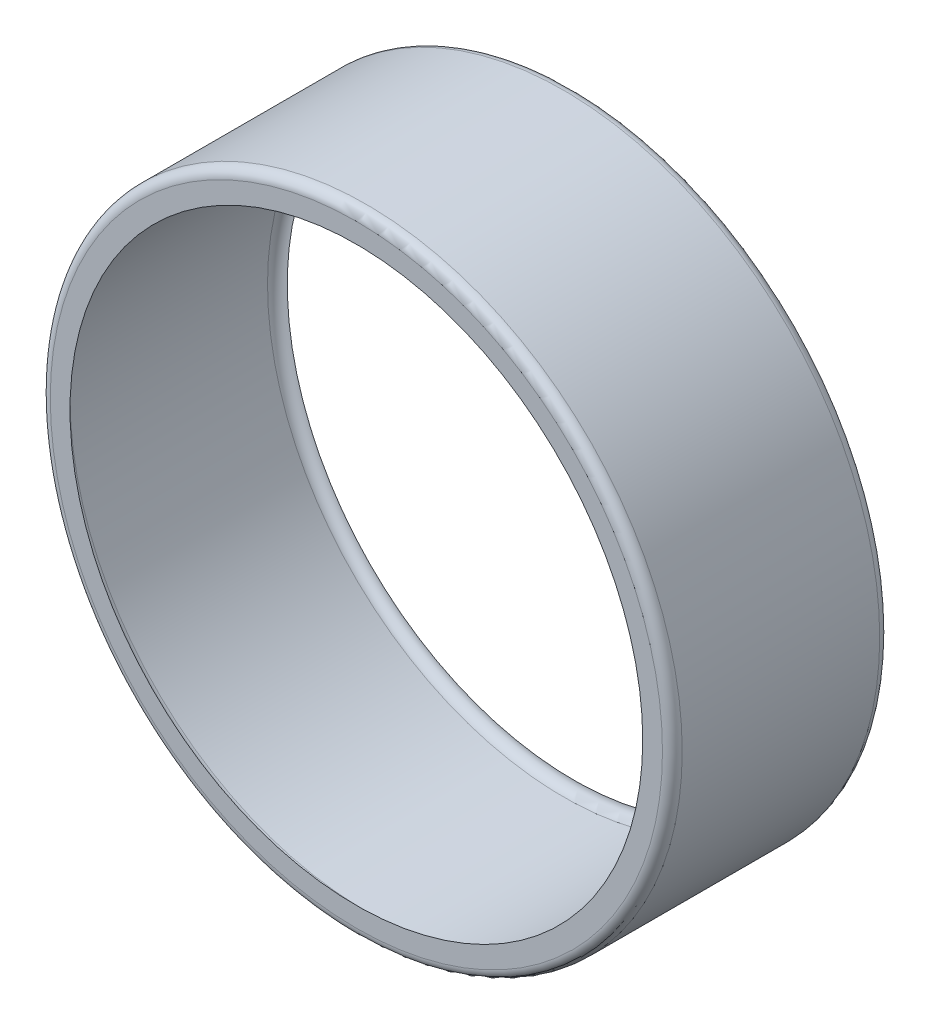
ISO-10303-21;
HEADER;
FILE_DESCRIPTION(('STEP AP214'),'2;1');
FILE_NAME('part.step','',(''),(''),'','','');
FILE_SCHEMA(('AUTOMOTIVE_DESIGN { 1 0 10303 214 1 1 1 1 }'));
ENDSEC;
DATA;
#1=APPLICATION_CONTEXT('core data for automotive mechanical design processes');
#2=APPLICATION_PROTOCOL_DEFINITION('international standard','automotive_design',2000,#1);
#3=PRODUCT_CONTEXT('',#1,'mechanical');
#4=PRODUCT('Part','Part','',(#3));
#5=PRODUCT_RELATED_PRODUCT_CATEGORY('part','',(#4));
#6=PRODUCT_DEFINITION_FORMATION('','',#4);
#7=PRODUCT_DEFINITION_CONTEXT('part definition',#1,'design');
#8=PRODUCT_DEFINITION('design','',#6,#7);
#9=PRODUCT_DEFINITION_SHAPE('','',#8);
#10=(LENGTH_UNIT() NAMED_UNIT(*) SI_UNIT(.MILLI.,.METRE.));
#11=(NAMED_UNIT(*) PLANE_ANGLE_UNIT() SI_UNIT($,.RADIAN.));
#12=(NAMED_UNIT(*) SI_UNIT($,.STERADIAN.) SOLID_ANGLE_UNIT());
#13=UNCERTAINTY_MEASURE_WITH_UNIT(LENGTH_MEASURE(1.E-05),#10,'distance_accuracy_value','');
#14=(GEOMETRIC_REPRESENTATION_CONTEXT(3) GLOBAL_UNCERTAINTY_ASSIGNED_CONTEXT((#13)) GLOBAL_UNIT_ASSIGNED_CONTEXT((#10,
#11,#12)) REPRESENTATION_CONTEXT('',''));
#15=CARTESIAN_POINT('',(0.,0.,0.));
#16=DIRECTION('',(0.,0.,1.));
#17=DIRECTION('',(1.,0.,0.));
#18=AXIS2_PLACEMENT_3D('',#15,#16,#17);
#19=CARTESIAN_POINT('',(0.,0.,22.));
#20=DIRECTION('',(0.,0.,-1.));
#21=DIRECTION('',(-1.,0.,0.));
#22=AXIS2_PLACEMENT_3D('',#19,#20,#21);
#23=CYLINDRICAL_SURFACE('',#22,32.);
#24=CARTESIAN_POINT('',(0.,0.,21.));
#25=DIRECTION('',(0.,0.,1.));
#26=DIRECTION('',(1.,0.,0.));
#27=AXIS2_PLACEMENT_3D('',#24,#25,#26);
#28=CIRCLE('',#27,32.);
#29=CARTESIAN_POINT('',(32.,0.,21.));
#30=VERTEX_POINT('',#29);
#31=EDGE_CURVE('E62',#30,#30,#28,.F.);
#32=ORIENTED_EDGE('',*,*,#31,.T.);
#33=EDGE_LOOP('',(#32));
#34=FACE_BOUND('',#33,.T.);
#35=CARTESIAN_POINT('',(0.,0.,1.));
#36=DIRECTION('',(0.,0.,1.));
#37=DIRECTION('',(1.,0.,0.));
#38=AXIS2_PLACEMENT_3D('',#35,#36,#37);
#39=CIRCLE('',#38,32.);
#40=CARTESIAN_POINT('',(32.,0.,1.));
#41=VERTEX_POINT('',#40);
#42=EDGE_CURVE('E59',#41,#41,#39,.T.);
#43=ORIENTED_EDGE('',*,*,#42,.T.);
#44=EDGE_LOOP('',(#43));
#45=FACE_BOUND('',#44,.T.);
#46=ADVANCED_FACE('F38',(#34,#45),#23,.T.);
#47=CARTESIAN_POINT('',(0.,0.,22.));
#48=DIRECTION('',(0.,0.,1.));
#49=DIRECTION('',(1.,0.,0.));
#50=AXIS2_PLACEMENT_3D('',#47,#48,#49);
#51=PLANE('',#50);
#52=CARTESIAN_POINT('',(0.,0.,22.));
#53=DIRECTION('',(0.,0.,1.));
#54=DIRECTION('',(1.,0.,0.));
#55=AXIS2_PLACEMENT_3D('',#52,#53,#54);
#56=CIRCLE('',#55,29.);
#57=CARTESIAN_POINT('',(29.,0.,22.));
#58=VERTEX_POINT('',#57);
#59=EDGE_CURVE('E42',#58,#58,#56,.T.);
#60=ORIENTED_EDGE('',*,*,#59,.F.);
#61=EDGE_LOOP('',(#60));
#62=FACE_BOUND('',#61,.T.);
#63=CARTESIAN_POINT('',(0.,0.,22.));
#64=DIRECTION('',(0.,0.,1.));
#65=DIRECTION('',(1.,0.,0.));
#66=AXIS2_PLACEMENT_3D('',#63,#64,#65);
#67=CIRCLE('',#66,31.);
#68=CARTESIAN_POINT('',(31.,0.,22.));
#69=VERTEX_POINT('',#68);
#70=EDGE_CURVE('E56',#69,#69,#67,.T.);
#71=ORIENTED_EDGE('',*,*,#70,.T.);
#72=EDGE_LOOP('',(#71));
#73=FACE_BOUND('',#72,.T.);
#74=ADVANCED_FACE('F40',(#62,#73),#51,.T.);
#75=CARTESIAN_POINT('',(0.,0.,0.));
#76=DIRECTION('',(0.,0.,1.));
#77=DIRECTION('',(1.,0.,0.));
#78=AXIS2_PLACEMENT_3D('',#75,#76,#77);
#79=PLANE('',#78);
#80=CARTESIAN_POINT('',(0.,0.,0.));
#81=DIRECTION('',(0.,0.,1.));
#82=DIRECTION('',(1.,0.,0.));
#83=AXIS2_PLACEMENT_3D('',#80,#81,#82);
#84=CIRCLE('',#83,29.);
#85=CARTESIAN_POINT('',(29.,0.,0.));
#86=VERTEX_POINT('',#85);
#87=EDGE_CURVE('E46',#86,#86,#84,.F.);
#88=ORIENTED_EDGE('',*,*,#87,.F.);
#89=EDGE_LOOP('',(#88));
#90=FACE_BOUND('',#89,.T.);
#91=CARTESIAN_POINT('',(0.,0.,0.));
#92=DIRECTION('',(0.,0.,1.));
#93=DIRECTION('',(1.,0.,0.));
#94=AXIS2_PLACEMENT_3D('',#91,#92,#93);
#95=CIRCLE('',#94,31.);
#96=CARTESIAN_POINT('',(31.,0.,0.));
#97=VERTEX_POINT('',#96);
#98=EDGE_CURVE('E54',#97,#97,#95,.F.);
#99=ORIENTED_EDGE('',*,*,#98,.T.);
#100=EDGE_LOOP('',(#99));
#101=FACE_BOUND('',#100,.T.);
#102=ADVANCED_FACE('F68',(#90,#101),#79,.F.);
#103=CARTESIAN_POINT('',(0.,0.,21.));
#104=DIRECTION('',(0.,0.,1.));
#105=DIRECTION('',(1.,0.,0.));
#106=AXIS2_PLACEMENT_3D('',#103,#104,#105);
#107=TOROIDAL_SURFACE('',#106,31.,1.);
#108=ORIENTED_EDGE('',*,*,#31,.F.);
#109=EDGE_LOOP('',(#108));
#110=FACE_BOUND('',#109,.T.);
#111=ORIENTED_EDGE('',*,*,#70,.F.);
#112=EDGE_LOOP('',(#111));
#113=FACE_BOUND('',#112,.T.);
#114=ADVANCED_FACE('F74',(#110,#113),#107,.T.);
#115=CARTESIAN_POINT('',(0.,0.,1.));
#116=DIRECTION('',(0.,0.,1.));
#117=DIRECTION('',(1.,0.,0.));
#118=AXIS2_PLACEMENT_3D('',#115,#116,#117);
#119=TOROIDAL_SURFACE('',#118,31.,1.);
#120=ORIENTED_EDGE('',*,*,#98,.F.);
#121=EDGE_LOOP('',(#120));
#122=FACE_BOUND('',#121,.T.);
#123=ORIENTED_EDGE('',*,*,#42,.F.);
#124=EDGE_LOOP('',(#123));
#125=FACE_BOUND('',#124,.T.);
#126=ADVANCED_FACE('F70',(#122,#125),#119,.T.);
#127=CARTESIAN_POINT('',(0.,0.,22.));
#128=DIRECTION('',(0.,0.,-1.));
#129=DIRECTION('',(-1.,0.,0.));
#130=AXIS2_PLACEMENT_3D('',#127,#128,#129);
#131=CYLINDRICAL_SURFACE('',#130,30.);
#132=CARTESIAN_POINT('',(0.,0.,21.));
#133=DIRECTION('',(0.,0.,1.));
#134=DIRECTION('',(1.,0.,0.));
#135=AXIS2_PLACEMENT_3D('',#132,#133,#134);
#136=CIRCLE('',#135,30.);
#137=CARTESIAN_POINT('',(30.,0.,21.));
#138=VERTEX_POINT('',#137);
#139=EDGE_CURVE('E52',#138,#138,#136,.F.);
#140=ORIENTED_EDGE('',*,*,#139,.F.);
#141=EDGE_LOOP('',(#140));
#142=FACE_BOUND('',#141,.T.);
#143=CARTESIAN_POINT('',(0.,0.,1.));
#144=DIRECTION('',(0.,0.,1.));
#145=DIRECTION('',(1.,0.,0.));
#146=AXIS2_PLACEMENT_3D('',#143,#144,#145);
#147=CIRCLE('',#146,30.);
#148=CARTESIAN_POINT('',(30.,0.,1.));
#149=VERTEX_POINT('',#148);
#150=EDGE_CURVE('E10',#149,#149,#147,.T.);
#151=ORIENTED_EDGE('',*,*,#150,.F.);
#152=EDGE_LOOP('',(#151));
#153=FACE_BOUND('',#152,.T.);
#154=ADVANCED_FACE('F73',(#142,#153),#131,.F.);
#155=CARTESIAN_POINT('',(0.,0.,21.));
#156=DIRECTION('',(0.,0.,1.));
#157=DIRECTION('',(1.,0.,0.));
#158=AXIS2_PLACEMENT_3D('',#155,#156,#157);
#159=TOROIDAL_SURFACE('',#158,29.,1.);
#160=ORIENTED_EDGE('',*,*,#139,.T.);
#161=EDGE_LOOP('',(#160));
#162=FACE_BOUND('',#161,.T.);
#163=ORIENTED_EDGE('',*,*,#59,.T.);
#164=EDGE_LOOP('',(#163));
#165=FACE_BOUND('',#164,.T.);
#166=ADVANCED_FACE('F91',(#162,#165),#159,.F.);
#167=CARTESIAN_POINT('',(0.,0.,1.));
#168=DIRECTION('',(0.,0.,1.));
#169=DIRECTION('',(1.,0.,0.));
#170=AXIS2_PLACEMENT_3D('',#167,#168,#169);
#171=TOROIDAL_SURFACE('',#170,29.,1.);
#172=ORIENTED_EDGE('',*,*,#87,.T.);
#173=EDGE_LOOP('',(#172));
#174=FACE_BOUND('',#173,.T.);
#175=ORIENTED_EDGE('',*,*,#150,.T.);
#176=EDGE_LOOP('',(#175));
#177=FACE_BOUND('',#176,.T.);
#178=ADVANCED_FACE('F88',(#174,#177),#171,.F.);
#179=CLOSED_SHELL('',(#46,#74,#102,#114,#126,#154,#166,#178));
#180=MANIFOLD_SOLID_BREP('B2',#179);
#181=ADVANCED_BREP_SHAPE_REPRESENTATION('',(#18,#180),#14);
#182=SHAPE_DEFINITION_REPRESENTATION(#9,#181);
ENDSEC;
END-ISO-10303-21;
